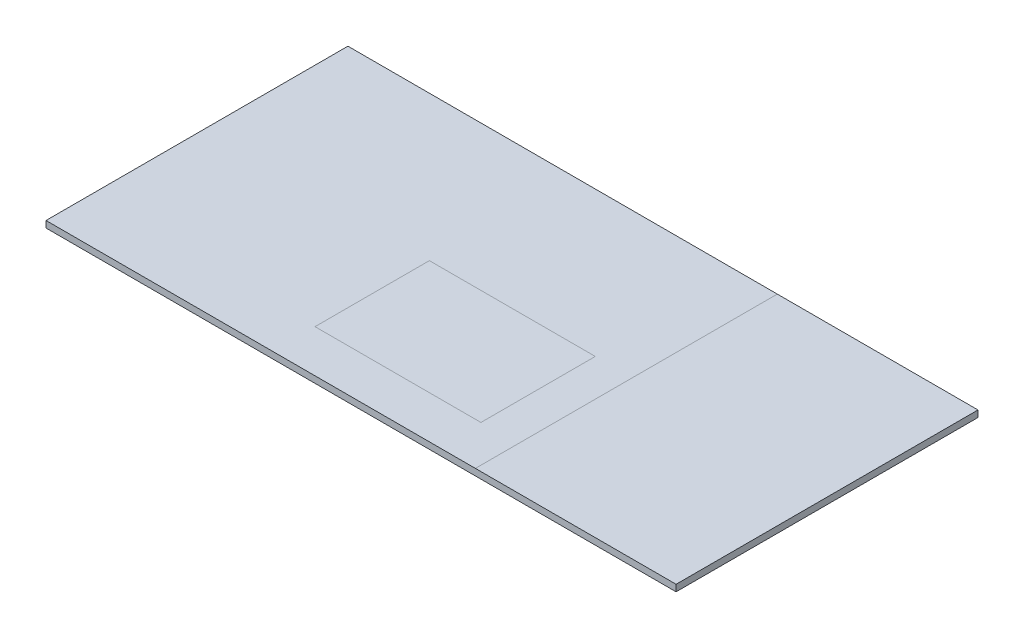
ISO-10303-21;
HEADER;
FILE_DESCRIPTION(('STEP AP214'),'2;1');
FILE_NAME('part.step','',(''),(''),'','','');
FILE_SCHEMA(('AUTOMOTIVE_DESIGN { 1 0 10303 214 1 1 1 1 }'));
ENDSEC;
DATA;
#1=APPLICATION_CONTEXT('core data for automotive mechanical design processes');
#2=APPLICATION_PROTOCOL_DEFINITION('international standard','automotive_design',2000,#1);
#3=PRODUCT_CONTEXT('',#1,'mechanical');
#4=PRODUCT('Part','Part','',(#3));
#5=PRODUCT_RELATED_PRODUCT_CATEGORY('part','',(#4));
#6=PRODUCT_DEFINITION_FORMATION('','',#4);
#7=PRODUCT_DEFINITION_CONTEXT('part definition',#1,'design');
#8=PRODUCT_DEFINITION('design','',#6,#7);
#9=PRODUCT_DEFINITION_SHAPE('','',#8);
#10=(LENGTH_UNIT() NAMED_UNIT(*) SI_UNIT(.MILLI.,.METRE.));
#11=(NAMED_UNIT(*) PLANE_ANGLE_UNIT() SI_UNIT($,.RADIAN.));
#12=(NAMED_UNIT(*) SI_UNIT($,.STERADIAN.) SOLID_ANGLE_UNIT());
#13=UNCERTAINTY_MEASURE_WITH_UNIT(LENGTH_MEASURE(1.E-05),#10,'distance_accuracy_value','');
#14=(GEOMETRIC_REPRESENTATION_CONTEXT(3) GLOBAL_UNCERTAINTY_ASSIGNED_CONTEXT((#13)) GLOBAL_UNIT_ASSIGNED_CONTEXT((#10,
#11,#12)) REPRESENTATION_CONTEXT('',''));
#15=CARTESIAN_POINT('',(0.,0.,0.));
#16=DIRECTION('',(0.,0.,1.));
#17=DIRECTION('',(1.,0.,0.));
#18=AXIS2_PLACEMENT_3D('',#15,#16,#17);
#19=CARTESIAN_POINT('',(0.,20.,0.));
#20=DIRECTION('',(0.,-1.,0.));
#21=DIRECTION('',(0.,0.,-1.));
#22=AXIS2_PLACEMENT_3D('',#19,#20,#21);
#23=PLANE('',#22);
#24=DIRECTION('',(0.,0.,1.));
#25=VECTOR('',#24,1.);
#26=CARTESIAN_POINT('',(690.099158827681,20.,0.));
#27=LINE('',#26,#25);
#28=CARTESIAN_POINT('',(690.099158827681,20.,-478.127668436947));
#29=VERTEX_POINT('',#28);
#30=CARTESIAN_POINT('',(690.099158827681,20.,-129.673597371192));
#31=VERTEX_POINT('',#30);
#32=EDGE_CURVE('E52',#29,#31,#27,.T.);
#33=ORIENTED_EDGE('',*,*,#32,.F.);
#34=DIRECTION('',(-1.,0.,0.));
#35=VECTOR('',#34,1.);
#36=CARTESIAN_POINT('',(0.,20.,-478.127668436947));
#37=LINE('',#36,#35);
#38=CARTESIAN_POINT('',(1195.65968968031,20.,-478.127668436947));
#39=VERTEX_POINT('',#38);
#40=EDGE_CURVE('E119',#39,#29,#37,.T.);
#41=ORIENTED_EDGE('',*,*,#40,.F.);
#42=DIRECTION('',(0.,0.,-1.));
#43=VECTOR('',#42,1.);
#44=CARTESIAN_POINT('',(1195.65968968031,20.,0.));
#45=LINE('',#44,#43);
#46=CARTESIAN_POINT('',(1195.65968968031,20.,-129.673597371192));
#47=VERTEX_POINT('',#46);
#48=EDGE_CURVE('E124',#47,#39,#45,.T.);
#49=ORIENTED_EDGE('',*,*,#48,.F.);
#50=DIRECTION('',(1.,0.,0.));
#51=VECTOR('',#50,1.);
#52=CARTESIAN_POINT('',(0.,20.,-129.673597371192));
#53=LINE('',#52,#51);
#54=EDGE_CURVE('E133',#31,#47,#53,.T.);
#55=ORIENTED_EDGE('',*,*,#54,.F.);
#56=EDGE_LOOP('',(#33,#41,#49,#55));
#57=FACE_BOUND('',#56,.T.);
#58=DIRECTION('',(0.,0.,1.));
#59=VECTOR('',#58,1.);
#60=CARTESIAN_POINT('',(1308.45407106575,20.,0.));
#61=LINE('',#60,#59);
#62=CARTESIAN_POINT('',(1308.45407106575,20.,-920.));
#63=VERTEX_POINT('',#62);
#64=CARTESIAN_POINT('',(1308.45407106575,20.,0.));
#65=VERTEX_POINT('',#64);
#66=EDGE_CURVE('E11',#63,#65,#61,.T.);
#67=ORIENTED_EDGE('',*,*,#66,.F.);
#68=DIRECTION('',(-1.,0.,0.));
#69=VECTOR('',#68,1.);
#70=CARTESIAN_POINT('',(0.,20.,-920.));
#71=LINE('',#70,#69);
#72=CARTESIAN_POINT('',(0.,20.,-920.));
#73=VERTEX_POINT('',#72);
#74=EDGE_CURVE('E111',#63,#73,#71,.T.);
#75=ORIENTED_EDGE('',*,*,#74,.T.);
#76=DIRECTION('',(0.,0.,1.));
#77=VECTOR('',#76,1.);
#78=CARTESIAN_POINT('',(0.,20.,0.));
#79=LINE('',#78,#77);
#80=CARTESIAN_POINT('',(0.,20.,0.));
#81=VERTEX_POINT('',#80);
#82=EDGE_CURVE('E110',#73,#81,#79,.T.);
#83=ORIENTED_EDGE('',*,*,#82,.T.);
#84=DIRECTION('',(1.,0.,0.));
#85=VECTOR('',#84,1.);
#86=CARTESIAN_POINT('',(0.,20.,0.));
#87=LINE('',#86,#85);
#88=EDGE_CURVE('E99',#81,#65,#87,.T.);
#89=ORIENTED_EDGE('',*,*,#88,.T.);
#90=EDGE_LOOP('',(#67,#75,#83,#89));
#91=FACE_BOUND('',#90,.T.);
#92=ADVANCED_FACE('F43',(#57,#91),#23,.F.);
#93=CARTESIAN_POINT('',(1920.,20.,-920.));
#94=VERTEX_POINT('',#93);
#95=EDGE_CURVE('E244',#94,#63,#71,.T.);
#96=ORIENTED_EDGE('',*,*,#95,.T.);
#97=ORIENTED_EDGE('',*,*,#66,.T.);
#98=CARTESIAN_POINT('',(1920.,20.,0.));
#99=VERTEX_POINT('',#98);
#100=EDGE_CURVE('E106',#65,#99,#87,.T.);
#101=ORIENTED_EDGE('',*,*,#100,.T.);
#102=DIRECTION('',(0.,0.,-1.));
#103=VECTOR('',#102,1.);
#104=CARTESIAN_POINT('',(1920.,20.,0.));
#105=LINE('',#104,#103);
#106=EDGE_CURVE('E107',#99,#94,#105,.T.);
#107=ORIENTED_EDGE('',*,*,#106,.T.);
#108=EDGE_LOOP('',(#96,#97,#101,#107));
#109=FACE_BOUND('',#108,.T.);
#110=ADVANCED_FACE('F145',(#109),#23,.F.);
#111=CARTESIAN_POINT('',(0.,20.,0.));
#112=DIRECTION('',(1.,0.,0.));
#113=DIRECTION('',(0.,0.,-1.));
#114=AXIS2_PLACEMENT_3D('',#111,#112,#113);
#115=PLANE('',#114);
#116=DIRECTION('',(0.,0.,1.));
#117=VECTOR('',#116,1.);
#118=CARTESIAN_POINT('',(0.,0.,0.));
#119=LINE('',#118,#117);
#120=CARTESIAN_POINT('',(0.,0.,-920.));
#121=VERTEX_POINT('',#120);
#122=CARTESIAN_POINT('',(0.,0.,0.));
#123=VERTEX_POINT('',#122);
#124=EDGE_CURVE('E118',#121,#123,#119,.T.);
#125=ORIENTED_EDGE('',*,*,#124,.T.);
#126=DIRECTION('',(0.,-1.,0.));
#127=VECTOR('',#126,1.);
#128=CARTESIAN_POINT('',(0.,20.,0.));
#129=LINE('',#128,#127);
#130=EDGE_CURVE('E103',#81,#123,#129,.T.);
#131=ORIENTED_EDGE('',*,*,#130,.F.);
#132=ORIENTED_EDGE('',*,*,#82,.F.);
#133=DIRECTION('',(0.,-1.,0.));
#134=VECTOR('',#133,1.);
#135=CARTESIAN_POINT('',(0.,20.,-920.));
#136=LINE('',#135,#134);
#137=EDGE_CURVE('E238',#73,#121,#136,.T.);
#138=ORIENTED_EDGE('',*,*,#137,.T.);
#139=EDGE_LOOP('',(#125,#131,#132,#138));
#140=FACE_BOUND('',#139,.T.);
#141=ADVANCED_FACE('F45',(#140),#115,.F.);
#142=CARTESIAN_POINT('',(0.,20.,0.));
#143=DIRECTION('',(0.,0.,-1.));
#144=DIRECTION('',(-1.,0.,0.));
#145=AXIS2_PLACEMENT_3D('',#142,#143,#144);
#146=PLANE('',#145);
#147=DIRECTION('',(1.,0.,0.));
#148=VECTOR('',#147,1.);
#149=CARTESIAN_POINT('',(0.,0.,0.));
#150=LINE('',#149,#148);
#151=CARTESIAN_POINT('',(1920.,0.,0.));
#152=VERTEX_POINT('',#151);
#153=EDGE_CURVE('E246',#123,#152,#150,.T.);
#154=ORIENTED_EDGE('',*,*,#153,.T.);
#155=DIRECTION('',(0.,-1.,0.));
#156=VECTOR('',#155,1.);
#157=CARTESIAN_POINT('',(1920.,20.,0.));
#158=LINE('',#157,#156);
#159=EDGE_CURVE('E120',#99,#152,#158,.T.);
#160=ORIENTED_EDGE('',*,*,#159,.F.);
#161=ORIENTED_EDGE('',*,*,#100,.F.);
#162=ORIENTED_EDGE('',*,*,#88,.F.);
#163=ORIENTED_EDGE('',*,*,#130,.T.);
#164=EDGE_LOOP('',(#154,#160,#161,#162,#163));
#165=FACE_BOUND('',#164,.T.);
#166=ADVANCED_FACE('F101',(#165),#146,.F.);
#167=CARTESIAN_POINT('',(1920.,20.,0.));
#168=DIRECTION('',(-1.,0.,0.));
#169=DIRECTION('',(0.,0.,1.));
#170=AXIS2_PLACEMENT_3D('',#167,#168,#169);
#171=PLANE('',#170);
#172=DIRECTION('',(0.,0.,-1.));
#173=VECTOR('',#172,1.);
#174=CARTESIAN_POINT('',(1920.,0.,0.));
#175=LINE('',#174,#173);
#176=CARTESIAN_POINT('',(1920.,0.,-920.));
#177=VERTEX_POINT('',#176);
#178=EDGE_CURVE('E242',#152,#177,#175,.T.);
#179=ORIENTED_EDGE('',*,*,#178,.T.);
#180=DIRECTION('',(0.,-1.,0.));
#181=VECTOR('',#180,1.);
#182=CARTESIAN_POINT('',(1920.,20.,-920.));
#183=LINE('',#182,#181);
#184=EDGE_CURVE('E127',#94,#177,#183,.T.);
#185=ORIENTED_EDGE('',*,*,#184,.F.);
#186=ORIENTED_EDGE('',*,*,#106,.F.);
#187=ORIENTED_EDGE('',*,*,#159,.T.);
#188=EDGE_LOOP('',(#179,#185,#186,#187));
#189=FACE_BOUND('',#188,.T.);
#190=ADVANCED_FACE('F159',(#189),#171,.F.);
#191=CARTESIAN_POINT('',(0.,20.,-920.));
#192=DIRECTION('',(0.,0.,1.));
#193=DIRECTION('',(1.,0.,0.));
#194=AXIS2_PLACEMENT_3D('',#191,#192,#193);
#195=PLANE('',#194);
#196=DIRECTION('',(-1.,0.,0.));
#197=VECTOR('',#196,1.);
#198=CARTESIAN_POINT('',(0.,0.,-920.));
#199=LINE('',#198,#197);
#200=EDGE_CURVE('E115',#177,#121,#199,.T.);
#201=ORIENTED_EDGE('',*,*,#200,.T.);
#202=ORIENTED_EDGE('',*,*,#137,.F.);
#203=ORIENTED_EDGE('',*,*,#74,.F.);
#204=ORIENTED_EDGE('',*,*,#95,.F.);
#205=ORIENTED_EDGE('',*,*,#184,.T.);
#206=EDGE_LOOP('',(#201,#202,#203,#204,#205));
#207=FACE_BOUND('',#206,.T.);
#208=ADVANCED_FACE('F153',(#207),#195,.F.);
#209=ORIENTED_EDGE('',*,*,#40,.T.);
#210=ORIENTED_EDGE('',*,*,#32,.T.);
#211=ORIENTED_EDGE('',*,*,#54,.T.);
#212=ORIENTED_EDGE('',*,*,#48,.T.);
#213=EDGE_LOOP('',(#209,#210,#211,#212));
#214=FACE_BOUND('',#213,.T.);
#215=ADVANCED_FACE('F140',(#214),#23,.F.);
#216=CARTESIAN_POINT('',(0.,0.,0.));
#217=DIRECTION('',(0.,-1.,0.));
#218=DIRECTION('',(0.,0.,-1.));
#219=AXIS2_PLACEMENT_3D('',#216,#217,#218);
#220=PLANE('',#219);
#221=ORIENTED_EDGE('',*,*,#124,.F.);
#222=ORIENTED_EDGE('',*,*,#200,.F.);
#223=ORIENTED_EDGE('',*,*,#178,.F.);
#224=ORIENTED_EDGE('',*,*,#153,.F.);
#225=EDGE_LOOP('',(#221,#222,#223,#224));
#226=FACE_BOUND('',#225,.T.);
#227=ADVANCED_FACE('F152',(#226),#220,.T.);
#228=CLOSED_SHELL('',(#92,#110,#141,#166,#190,#208,#215,#227));
#229=MANIFOLD_SOLID_BREP('B2',#228);
#230=ADVANCED_BREP_SHAPE_REPRESENTATION('',(#18,#229),#14);
#231=SHAPE_DEFINITION_REPRESENTATION(#9,#230);
ENDSEC;
END-ISO-10303-21;
